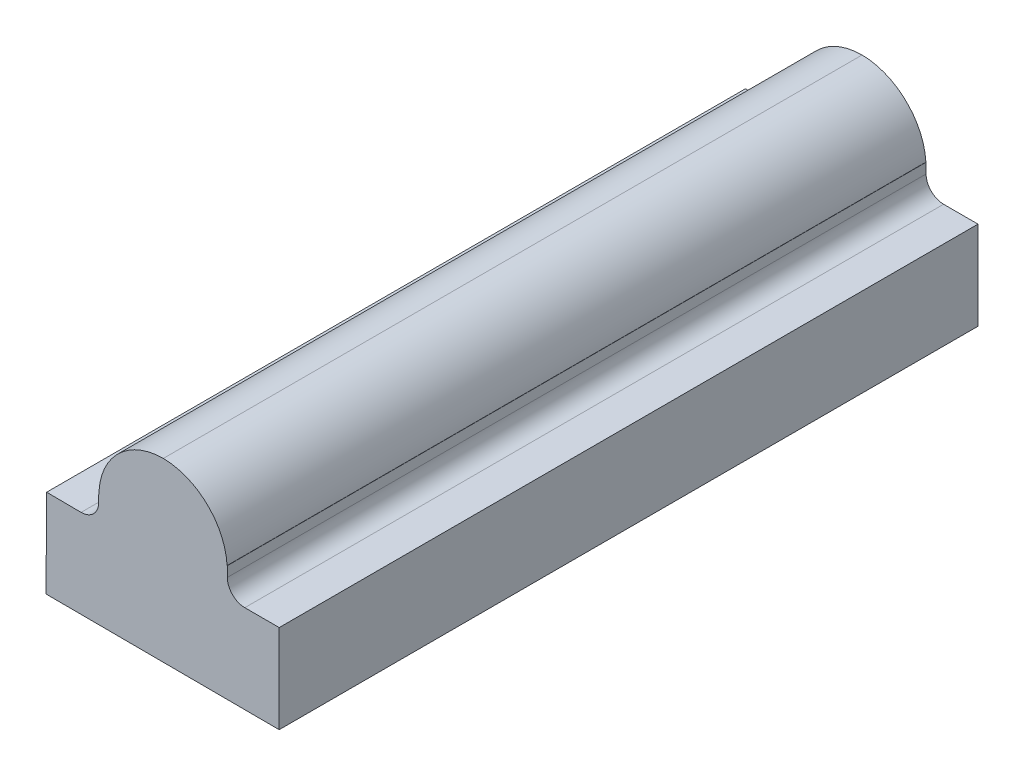
ISO-10303-21;
HEADER;
FILE_DESCRIPTION(('STEP AP214'),'2;1');
FILE_NAME('part.step','',(''),(''),'','','');
FILE_SCHEMA(('AUTOMOTIVE_DESIGN { 1 0 10303 214 1 1 1 1 }'));
ENDSEC;
DATA;
#1=APPLICATION_CONTEXT('core data for automotive mechanical design processes');
#2=APPLICATION_PROTOCOL_DEFINITION('international standard','automotive_design',2000,#1);
#3=PRODUCT_CONTEXT('',#1,'mechanical');
#4=PRODUCT('Part','Part','',(#3));
#5=PRODUCT_RELATED_PRODUCT_CATEGORY('part','',(#4));
#6=PRODUCT_DEFINITION_FORMATION('','',#4);
#7=PRODUCT_DEFINITION_CONTEXT('part definition',#1,'design');
#8=PRODUCT_DEFINITION('design','',#6,#7);
#9=PRODUCT_DEFINITION_SHAPE('','',#8);
#10=(LENGTH_UNIT() NAMED_UNIT(*) SI_UNIT(.MILLI.,.METRE.));
#11=(NAMED_UNIT(*) PLANE_ANGLE_UNIT() SI_UNIT($,.RADIAN.));
#12=(NAMED_UNIT(*) SI_UNIT($,.STERADIAN.) SOLID_ANGLE_UNIT());
#13=UNCERTAINTY_MEASURE_WITH_UNIT(LENGTH_MEASURE(1.E-05),#10,'distance_accuracy_value','');
#14=(GEOMETRIC_REPRESENTATION_CONTEXT(3) GLOBAL_UNCERTAINTY_ASSIGNED_CONTEXT((#13)) GLOBAL_UNIT_ASSIGNED_CONTEXT((#10,
#11,#12)) REPRESENTATION_CONTEXT('',''));
#15=CARTESIAN_POINT('',(0.,0.,0.));
#16=DIRECTION('',(0.,0.,1.));
#17=DIRECTION('',(1.,0.,0.));
#18=AXIS2_PLACEMENT_3D('',#15,#16,#17);
#19=CARTESIAN_POINT('',(-14.5610189157641,43.254441665146,3.));
#20=DIRECTION('',(0.,0.,-1.));
#21=DIRECTION('',(-1.,0.,0.));
#22=AXIS2_PLACEMENT_3D('',#19,#20,#21);
#23=CYLINDRICAL_SURFACE('',#22,0.555000000000011);
#24=CARTESIAN_POINT('',(-14.5610189157641,43.254441665146,-3.));
#25=DIRECTION('',(0.,0.,1.));
#26=DIRECTION('',(1.,0.,0.));
#27=AXIS2_PLACEMENT_3D('',#24,#25,#26);
#28=CIRCLE('',#27,0.555000000000011);
#29=CARTESIAN_POINT('',(-14.0069614198133,43.286772628335,-3.));
#30=VERTEX_POINT('',#29);
#31=CARTESIAN_POINT('',(-14.5548588552216,43.8094074781959,-3.));
#32=VERTEX_POINT('',#31);
#33=EDGE_CURVE('E211',#30,#32,#28,.T.);
#34=ORIENTED_EDGE('',*,*,#33,.T.);
#35=DIRECTION('',(0.,0.,-1.));
#36=VECTOR('',#35,1.);
#37=CARTESIAN_POINT('',(-14.5548588552216,43.8094074781959,3.));
#38=LINE('',#37,#36);
#39=CARTESIAN_POINT('',(-14.5548588552216,43.8094074781959,3.));
#40=VERTEX_POINT('',#39);
#41=EDGE_CURVE('E43',#40,#32,#38,.T.);
#42=ORIENTED_EDGE('',*,*,#41,.F.);
#43=CARTESIAN_POINT('',(-14.5610189157641,43.254441665146,3.));
#44=DIRECTION('',(0.,0.,1.));
#45=DIRECTION('',(1.,0.,0.));
#46=AXIS2_PLACEMENT_3D('',#43,#44,#45);
#47=CIRCLE('',#46,0.555000000000011);
#48=CARTESIAN_POINT('',(-14.0069614198133,43.286772628335,3.));
#49=VERTEX_POINT('',#48);
#50=EDGE_CURVE('E212',#49,#40,#47,.T.);
#51=ORIENTED_EDGE('',*,*,#50,.F.);
#52=DIRECTION('',(0.,0.,-1.));
#53=VECTOR('',#52,1.);
#54=CARTESIAN_POINT('',(-14.0069614198133,43.286772628335,3.));
#55=LINE('',#54,#53);
#56=EDGE_CURVE('E225',#49,#30,#55,.T.);
#57=ORIENTED_EDGE('',*,*,#56,.T.);
#58=EDGE_LOOP('',(#34,#42,#51,#57));
#59=FACE_BOUND('',#58,.T.);
#60=ADVANCED_FACE('F34',(#59),#23,.T.);
#61=CARTESIAN_POINT('',(-14.5600764117149,42.536772628335,3.));
#62=DIRECTION('',(1.,0.,0.));
#63=DIRECTION('',(0.,0.,-1.));
#64=AXIS2_PLACEMENT_3D('',#61,#62,#63);
#65=PLANE('',#64);
#66=DIRECTION('',(0.,-1.,0.));
#67=VECTOR('',#66,1.);
#68=CARTESIAN_POINT('',(-14.5600764117149,42.536772628335,-3.));
#69=LINE('',#68,#67);
#70=CARTESIAN_POINT('',(-14.5600764117149,42.536772628335,-3.));
#71=VERTEX_POINT('',#70);
#72=CARTESIAN_POINT('',(-14.5600764117149,42.2935072825846,-3.));
#73=VERTEX_POINT('',#72);
#74=EDGE_CURVE('E227',#71,#73,#69,.T.);
#75=ORIENTED_EDGE('',*,*,#74,.T.);
#76=DIRECTION('',(0.,0.,1.));
#77=VECTOR('',#76,1.);
#78=CARTESIAN_POINT('',(-14.5600764117149,42.2935072825846,3.));
#79=LINE('',#78,#77);
#80=CARTESIAN_POINT('',(-14.5600764117149,42.2935072825846,3.));
#81=VERTEX_POINT('',#80);
#82=EDGE_CURVE('E160',#73,#81,#79,.T.);
#83=ORIENTED_EDGE('',*,*,#82,.T.);
#84=DIRECTION('',(0.,-1.,0.));
#85=VECTOR('',#84,1.);
#86=CARTESIAN_POINT('',(-14.5600764117149,42.536772628335,3.));
#87=LINE('',#86,#85);
#88=CARTESIAN_POINT('',(-14.5600764117149,42.536772628335,3.));
#89=VERTEX_POINT('',#88);
#90=EDGE_CURVE('E214',#89,#81,#87,.T.);
#91=ORIENTED_EDGE('',*,*,#90,.F.);
#92=DIRECTION('',(0.,0.,-1.));
#93=VECTOR('',#92,1.);
#94=CARTESIAN_POINT('',(-14.5600764117149,42.536772628335,3.));
#95=LINE('',#94,#93);
#96=EDGE_CURVE('E248',#89,#71,#95,.T.);
#97=ORIENTED_EDGE('',*,*,#96,.T.);
#98=EDGE_LOOP('',(#75,#83,#91,#97));
#99=FACE_BOUND('',#98,.T.);
#100=ADVANCED_FACE('F310',(#99),#65,.F.);
#101=CARTESIAN_POINT('',(-13.2638702513963,43.0494074781959,3.));
#102=DIRECTION('',(0.,-1.,0.));
#103=DIRECTION('',(1.,0.,0.));
#104=AXIS2_PLACEMENT_3D('',#101,#102,#103);
#105=PLANE('',#104);
#106=DIRECTION('',(-1.,0.,0.));
#107=VECTOR('',#106,1.);
#108=CARTESIAN_POINT('',(-13.2638702513963,43.0494074781959,3.));
#109=LINE('',#108,#107);
#110=CARTESIAN_POINT('',(-13.5594733315556,43.0494074781959,3.));
#111=VERTEX_POINT('',#110);
#112=CARTESIAN_POINT('',(-13.8550764117149,43.0494074781959,3.));
#113=VERTEX_POINT('',#112);
#114=EDGE_CURVE('E37',#111,#113,#109,.T.);
#115=ORIENTED_EDGE('',*,*,#114,.F.);
#116=DIRECTION('',(0.,0.,1.));
#117=VECTOR('',#116,1.);
#118=CARTESIAN_POINT('',(-13.5594733315556,43.0494074781959,-3.));
#119=LINE('',#118,#117);
#120=CARTESIAN_POINT('',(-13.5594733315556,43.0494074781959,-3.));
#121=VERTEX_POINT('',#120);
#122=EDGE_CURVE('E281',#121,#111,#119,.T.);
#123=ORIENTED_EDGE('',*,*,#122,.F.);
#124=DIRECTION('',(-1.,0.,0.));
#125=VECTOR('',#124,1.);
#126=CARTESIAN_POINT('',(-13.2638702513963,43.0494074781959,-3.));
#127=LINE('',#126,#125);
#128=CARTESIAN_POINT('',(-13.8550764117149,43.0494074781959,-3.));
#129=VERTEX_POINT('',#128);
#130=EDGE_CURVE('E230',#121,#129,#127,.T.);
#131=ORIENTED_EDGE('',*,*,#130,.T.);
#132=DIRECTION('',(0.,0.,-1.));
#133=VECTOR('',#132,1.);
#134=CARTESIAN_POINT('',(-13.8550764117149,43.0494074781959,3.));
#135=LINE('',#134,#133);
#136=EDGE_CURVE('E245',#113,#129,#135,.T.);
#137=ORIENTED_EDGE('',*,*,#136,.F.);
#138=EDGE_LOOP('',(#115,#123,#131,#137));
#139=FACE_BOUND('',#138,.T.);
#140=ADVANCED_FACE('F319',(#139),#105,.F.);
#141=CARTESIAN_POINT('',(-13.8550764117149,43.1994074781959,3.));
#142=DIRECTION('',(0.,0.,-1.));
#143=DIRECTION('',(-1.,0.,0.));
#144=AXIS2_PLACEMENT_3D('',#141,#142,#143);
#145=CYLINDRICAL_SURFACE('',#144,0.149999999999998);
#146=CARTESIAN_POINT('',(-13.8550764117149,43.1994074781959,-3.));
#147=DIRECTION('',(0.,0.,-1.));
#148=DIRECTION('',(1.,0.,0.));
#149=AXIS2_PLACEMENT_3D('',#146,#147,#148);
#150=CIRCLE('',#149,0.149999999999998);
#151=CARTESIAN_POINT('',(-14.0050764117149,43.1994074781959,-3.));
#152=VERTEX_POINT('',#151);
#153=EDGE_CURVE('E232',#129,#152,#150,.T.);
#154=ORIENTED_EDGE('',*,*,#153,.T.);
#155=DIRECTION('',(0.,0.,-1.));
#156=VECTOR('',#155,1.);
#157=CARTESIAN_POINT('',(-14.0050764117149,43.1994074781959,3.));
#158=LINE('',#157,#156);
#159=CARTESIAN_POINT('',(-14.0050764117149,43.1994074781959,3.));
#160=VERTEX_POINT('',#159);
#161=EDGE_CURVE('E242',#160,#152,#158,.T.);
#162=ORIENTED_EDGE('',*,*,#161,.F.);
#163=CARTESIAN_POINT('',(-13.8550764117149,43.1994074781959,3.));
#164=DIRECTION('',(0.,0.,-1.));
#165=DIRECTION('',(1.,0.,0.));
#166=AXIS2_PLACEMENT_3D('',#163,#164,#165);
#167=CIRCLE('',#166,0.149999999999998);
#168=EDGE_CURVE('E219',#113,#160,#167,.T.);
#169=ORIENTED_EDGE('',*,*,#168,.F.);
#170=ORIENTED_EDGE('',*,*,#136,.T.);
#171=EDGE_LOOP('',(#154,#162,#169,#170));
#172=FACE_BOUND('',#171,.T.);
#173=ADVANCED_FACE('F326',(#172),#145,.F.);
#174=CARTESIAN_POINT('',(-14.0050764117149,43.1994074781959,3.));
#175=DIRECTION('',(-1.,0.,0.));
#176=DIRECTION('',(0.,0.,1.));
#177=AXIS2_PLACEMENT_3D('',#174,#175,#176);
#178=PLANE('',#177);
#179=DIRECTION('',(0.,1.,0.));
#180=VECTOR('',#179,1.);
#181=CARTESIAN_POINT('',(-14.0050764117149,43.1994074781959,-3.));
#182=LINE('',#181,#180);
#183=CARTESIAN_POINT('',(-14.0050764117149,43.286772628335,-3.));
#184=VERTEX_POINT('',#183);
#185=EDGE_CURVE('E234',#152,#184,#182,.T.);
#186=ORIENTED_EDGE('',*,*,#185,.T.);
#187=DIRECTION('',(0.,0.,-1.));
#188=VECTOR('',#187,1.);
#189=CARTESIAN_POINT('',(-14.0050764117149,43.286772628335,3.));
#190=LINE('',#189,#188);
#191=CARTESIAN_POINT('',(-14.0050764117149,43.286772628335,3.));
#192=VERTEX_POINT('',#191);
#193=EDGE_CURVE('E239',#192,#184,#190,.T.);
#194=ORIENTED_EDGE('',*,*,#193,.F.);
#195=DIRECTION('',(0.,1.,0.));
#196=VECTOR('',#195,1.);
#197=CARTESIAN_POINT('',(-14.0050764117149,43.1994074781959,3.));
#198=LINE('',#197,#196);
#199=EDGE_CURVE('E221',#160,#192,#198,.T.);
#200=ORIENTED_EDGE('',*,*,#199,.F.);
#201=ORIENTED_EDGE('',*,*,#161,.T.);
#202=EDGE_LOOP('',(#186,#194,#200,#201));
#203=FACE_BOUND('',#202,.T.);
#204=ADVANCED_FACE('F329',(#203),#178,.F.);
#205=CARTESIAN_POINT('',(-14.0050764117149,43.286772628335,3.));
#206=DIRECTION('',(0.,-1.,0.));
#207=DIRECTION('',(0.,0.,-1.));
#208=AXIS2_PLACEMENT_3D('',#205,#206,#207);
#209=PLANE('',#208);
#210=DIRECTION('',(-1.,0.,0.));
#211=VECTOR('',#210,1.);
#212=CARTESIAN_POINT('',(-14.0050764117149,43.286772628335,-3.));
#213=LINE('',#212,#211);
#214=EDGE_CURVE('E215',#184,#30,#213,.T.);
#215=ORIENTED_EDGE('',*,*,#214,.T.);
#216=ORIENTED_EDGE('',*,*,#56,.F.);
#217=DIRECTION('',(-1.,0.,0.));
#218=VECTOR('',#217,1.);
#219=CARTESIAN_POINT('',(-14.0050764117149,43.286772628335,3.));
#220=LINE('',#219,#218);
#221=EDGE_CURVE('E223',#192,#49,#220,.T.);
#222=ORIENTED_EDGE('',*,*,#221,.F.);
#223=ORIENTED_EDGE('',*,*,#193,.T.);
#224=EDGE_LOOP('',(#215,#216,#222,#223));
#225=FACE_BOUND('',#224,.T.);
#226=ADVANCED_FACE('F333',(#225),#209,.F.);
#227=CARTESIAN_POINT('',(-14.5610189157641,43.254441665146,3.));
#228=DIRECTION('',(0.,0.,1.));
#229=DIRECTION('',(1.,0.,0.));
#230=AXIS2_PLACEMENT_3D('',#227,#228,#229);
#231=PLANE('',#230);
#232=DIRECTION('',(0.00740532956584294,0.999972580171087,0.));
#233=VECTOR('',#232,1.);
#234=CARTESIAN_POINT('',(-15.5549302538437,43.2618021079858,3.));
#235=LINE('',#234,#233);
#236=CARTESIAN_POINT('',(-15.5620705709679,42.2976152646443,3.));
#237=VERTEX_POINT('',#236);
#238=CARTESIAN_POINT('',(-15.5564425187231,43.0575946652359,3.000006));
#239=VERTEX_POINT('',#238);
#240=EDGE_CURVE('E149',#237,#239,#235,.T.);
#241=ORIENTED_EDGE('',*,*,#240,.F.);
#242=DIRECTION('',(-0.999991595899715,0.0040997719377291,0.));
#243=VECTOR('',#242,1.);
#244=CARTESIAN_POINT('',(-14.5649584786291,42.2935272981137,3.));
#245=LINE('',#244,#243);
#246=CARTESIAN_POINT('',(-14.5620710598274,42.2935154602557,3.));
#247=VERTEX_POINT('',#246);
#248=EDGE_CURVE('E169',#247,#237,#245,.T.);
#249=ORIENTED_EDGE('',*,*,#248,.F.);
#250=DIRECTION('',(-0.00819947496566511,-0.999966383740117,0.));
#251=VECTOR('',#250,1.);
#252=CARTESIAN_POINT('',(-14.5600764117149,42.536772628335,3.));
#253=LINE('',#252,#251);
#254=EDGE_CURVE('E176',#89,#247,#253,.T.);
#255=ORIENTED_EDGE('',*,*,#254,.F.);
#256=ORIENTED_EDGE('',*,*,#90,.T.);
#257=CARTESIAN_POINT('',(-13.5600769005744,42.2894074781959,3.));
#258=VERTEX_POINT('',#257);
#259=EDGE_CURVE('E295',#258,#81,#245,.T.);
#260=ORIENTED_EDGE('',*,*,#259,.F.);
#261=DIRECTION('',(-0.000794169511106905,-0.999999684647344,0.));
#262=VECTOR('',#261,1.);
#263=CARTESIAN_POINT('',(-13.559311131387,43.2536461391137,3.));
#264=LINE('',#263,#262);
#265=EDGE_CURVE('E159',#111,#258,#264,.T.);
#266=ORIENTED_EDGE('',*,*,#265,.F.);
#267=ORIENTED_EDGE('',*,*,#114,.T.);
#268=ORIENTED_EDGE('',*,*,#168,.T.);
#269=ORIENTED_EDGE('',*,*,#199,.T.);
#270=ORIENTED_EDGE('',*,*,#221,.T.);
#271=ORIENTED_EDGE('',*,*,#50,.T.);
#272=CARTESIAN_POINT('',(-14.5532494300482,43.2544098117588,3.));
#273=DIRECTION('',(0.,0.,-1.));
#274=DIRECTION('',(-0.999966383740117,0.0081994749656651,0.));
#275=AXIS2_PLACEMENT_3D('',#272,#273,#274);
#276=CIRCLE('',#275,0.555000000000011);
#277=CARTESIAN_POINT('',(-15.107023203735,43.2912826686693,3.));
#278=VERTEX_POINT('',#277);
#279=EDGE_CURVE('E203',#278,#40,#276,.T.);
#280=ORIENTED_EDGE('',*,*,#279,.F.);
#281=DIRECTION('',(0.999966383740117,-0.0081994749656651,0.));
#282=VECTOR('',#281,1.);
#283=CARTESIAN_POINT('',(-15.1089081484664,43.291298124746,3.));
#284=LINE('',#283,#282);
#285=CARTESIAN_POINT('',(-15.1089081484664,43.291298124746,3.));
#286=VERTEX_POINT('',#285);
#287=EDGE_CURVE('E268',#286,#278,#284,.T.);
#288=ORIENTED_EDGE('',*,*,#287,.F.);
#289=DIRECTION('',(0.00819947496566511,0.999966383740117,0.));
#290=VECTOR('',#289,1.);
#291=CARTESIAN_POINT('',(-15.1096244968279,43.2039359114965,3.));
#292=LINE('',#291,#290);
#293=CARTESIAN_POINT('',(-15.1096244968279,43.2039359114965,3.));
#294=VERTEX_POINT('',#293);
#295=EDGE_CURVE('E180',#294,#286,#292,.T.);
#296=ORIENTED_EDGE('',*,*,#295,.F.);
#297=CARTESIAN_POINT('',(-15.2596194543889,43.2051658327414,3.));
#298=DIRECTION('',(0.,0.,1.));
#299=DIRECTION('',(-0.999966383740117,0.0081994749656651,0.));
#300=AXIS2_PLACEMENT_3D('',#297,#298,#299);
#301=CIRCLE('',#300,0.149999999999998);
#302=CARTESIAN_POINT('',(-15.2608493756337,43.0551708751804,3.));
#303=VERTEX_POINT('',#302);
#304=EDGE_CURVE('E175',#303,#294,#301,.T.);
#305=ORIENTED_EDGE('',*,*,#304,.F.);
#306=DIRECTION('',(0.999966383740118,-0.00819947496562989,0.));
#307=VECTOR('',#306,1.);
#308=CARTESIAN_POINT('',(-15.8520356618124,43.0600184552914,3.));
#309=LINE('',#308,#307);
#310=EDGE_CURVE('E166',#239,#303,#309,.T.);
#311=ORIENTED_EDGE('',*,*,#310,.F.);
#312=EDGE_LOOP('',(#241,#249,#255,#256,#260,#266,#267,#268,#269,#270,#271,#280,#288,#296,#305,#311));
#313=FACE_BOUND('',#312,.T.);
#314=ADVANCED_FACE('F172',(#313),#231,.T.);
#315=CARTESIAN_POINT('',(-14.5610189157641,43.254441665146,-3.));
#316=DIRECTION('',(0.,0.,1.));
#317=DIRECTION('',(1.,0.,0.));
#318=AXIS2_PLACEMENT_3D('',#315,#316,#317);
#319=PLANE('',#318);
#320=DIRECTION('',(-0.999991595899715,0.0040997719377291,0.));
#321=VECTOR('',#320,1.);
#322=CARTESIAN_POINT('',(-15.5620705709679,42.2976152646443,-3.));
#323=LINE('',#322,#321);
#324=CARTESIAN_POINT('',(-14.5620710598274,42.2935154602557,-3.));
#325=VERTEX_POINT('',#324);
#326=CARTESIAN_POINT('',(-15.5620705709679,42.2976152646443,-3.));
#327=VERTEX_POINT('',#326);
#328=EDGE_CURVE('E58',#325,#327,#323,.T.);
#329=ORIENTED_EDGE('',*,*,#328,.T.);
#330=DIRECTION('',(0.00740532956584294,0.999972580171087,0.));
#331=VECTOR('',#330,1.);
#332=CARTESIAN_POINT('',(-15.5564425187231,43.0575946652359,-3.));
#333=LINE('',#332,#331);
#334=CARTESIAN_POINT('',(-15.5564425187231,43.0575946652359,-3.));
#335=VERTEX_POINT('',#334);
#336=EDGE_CURVE('E280',#327,#335,#333,.T.);
#337=ORIENTED_EDGE('',*,*,#336,.T.);
#338=DIRECTION('',(0.999966383740118,-0.00819947496562989,0.));
#339=VECTOR('',#338,1.);
#340=CARTESIAN_POINT('',(-15.8520356618124,43.0600184552914,-3.));
#341=LINE('',#340,#339);
#342=CARTESIAN_POINT('',(-15.2608493756337,43.0551708751804,-3.));
#343=VERTEX_POINT('',#342);
#344=EDGE_CURVE('E168',#335,#343,#341,.T.);
#345=ORIENTED_EDGE('',*,*,#344,.T.);
#346=CARTESIAN_POINT('',(-15.2596194543889,43.2051658327414,-3.));
#347=DIRECTION('',(0.,0.,1.));
#348=DIRECTION('',(-0.999966383740117,0.0081994749656651,0.));
#349=AXIS2_PLACEMENT_3D('',#346,#347,#348);
#350=CIRCLE('',#349,0.149999999999998);
#351=CARTESIAN_POINT('',(-15.1096244968279,43.2039359114965,-3.));
#352=VERTEX_POINT('',#351);
#353=EDGE_CURVE('E196',#343,#352,#350,.T.);
#354=ORIENTED_EDGE('',*,*,#353,.T.);
#355=DIRECTION('',(0.00819947496566511,0.999966383740117,0.));
#356=VECTOR('',#355,1.);
#357=CARTESIAN_POINT('',(-15.1096244968279,43.2039359114965,-3.));
#358=LINE('',#357,#356);
#359=CARTESIAN_POINT('',(-15.1089081484664,43.291298124746,-3.));
#360=VERTEX_POINT('',#359);
#361=EDGE_CURVE('E193',#352,#360,#358,.T.);
#362=ORIENTED_EDGE('',*,*,#361,.T.);
#363=DIRECTION('',(0.999966383740117,-0.0081994749656651,0.));
#364=VECTOR('',#363,1.);
#365=CARTESIAN_POINT('',(-15.1089081484664,43.291298124746,-3.));
#366=LINE('',#365,#364);
#367=CARTESIAN_POINT('',(-15.107023203735,43.2912826686693,-3.));
#368=VERTEX_POINT('',#367);
#369=EDGE_CURVE('E190',#360,#368,#366,.T.);
#370=ORIENTED_EDGE('',*,*,#369,.T.);
#371=CARTESIAN_POINT('',(-14.5532494300482,43.2544098117588,-3.));
#372=DIRECTION('',(0.,0.,-1.));
#373=DIRECTION('',(-0.999966383740117,0.0081994749656651,0.));
#374=AXIS2_PLACEMENT_3D('',#371,#372,#373);
#375=CIRCLE('',#374,0.555000000000011);
#376=EDGE_CURVE('E187',#368,#32,#375,.T.);
#377=ORIENTED_EDGE('',*,*,#376,.T.);
#378=ORIENTED_EDGE('',*,*,#33,.F.);
#379=ORIENTED_EDGE('',*,*,#214,.F.);
#380=ORIENTED_EDGE('',*,*,#185,.F.);
#381=ORIENTED_EDGE('',*,*,#153,.F.);
#382=ORIENTED_EDGE('',*,*,#130,.F.);
#383=DIRECTION('',(-0.000794169511106905,-0.999999684647344,0.));
#384=VECTOR('',#383,1.);
#385=CARTESIAN_POINT('',(-13.5600769005744,42.2894074781959,-3.));
#386=LINE('',#385,#384);
#387=CARTESIAN_POINT('',(-13.5600769005744,42.2894074781959,-3.));
#388=VERTEX_POINT('',#387);
#389=EDGE_CURVE('E316',#121,#388,#386,.T.);
#390=ORIENTED_EDGE('',*,*,#389,.T.);
#391=EDGE_CURVE('E51',#388,#73,#323,.T.);
#392=ORIENTED_EDGE('',*,*,#391,.T.);
#393=ORIENTED_EDGE('',*,*,#74,.F.);
#394=DIRECTION('',(-0.00819947496566511,-0.999966383740117,0.));
#395=VECTOR('',#394,1.);
#396=CARTESIAN_POINT('',(-14.5600764117149,42.536772628335,-3.));
#397=LINE('',#396,#395);
#398=EDGE_CURVE('E200',#71,#325,#397,.T.);
#399=ORIENTED_EDGE('',*,*,#398,.T.);
#400=EDGE_LOOP('',(#329,#337,#345,#354,#362,#370,#377,#378,#379,#380,#381,#382,#390,#392,#393,#399));
#401=FACE_BOUND('',#400,.T.);
#402=ADVANCED_FACE('F260',(#401),#319,.F.);
#403=CARTESIAN_POINT('',(-14.5532494300482,43.2544098117588,3.));
#404=DIRECTION('',(0.,0.,-1.));
#405=DIRECTION('',(-1.,0.,0.));
#406=AXIS2_PLACEMENT_3D('',#403,#404,#405);
#407=CYLINDRICAL_SURFACE('',#406,0.555000000000011);
#408=ORIENTED_EDGE('',*,*,#376,.F.);
#409=DIRECTION('',(0.,0.,-1.));
#410=VECTOR('',#409,1.);
#411=CARTESIAN_POINT('',(-15.107023203735,43.2912826686693,3.));
#412=LINE('',#411,#410);
#413=EDGE_CURVE('E209',#278,#368,#412,.T.);
#414=ORIENTED_EDGE('',*,*,#413,.F.);
#415=ORIENTED_EDGE('',*,*,#279,.T.);
#416=ORIENTED_EDGE('',*,*,#41,.T.);
#417=EDGE_LOOP('',(#408,#414,#415,#416));
#418=FACE_BOUND('',#417,.T.);
#419=ADVANCED_FACE('F254',(#418),#407,.T.);
#420=CARTESIAN_POINT('',(-15.1089081484664,43.291298124746,3.));
#421=DIRECTION('',(0.0081994749656651,0.999966383740117,0.));
#422=DIRECTION('',(-0.999966383740117,0.0081994749656651,0.));
#423=AXIS2_PLACEMENT_3D('',#420,#421,#422);
#424=PLANE('',#423);
#425=ORIENTED_EDGE('',*,*,#369,.F.);
#426=DIRECTION('',(0.,0.,-1.));
#427=VECTOR('',#426,1.);
#428=CARTESIAN_POINT('',(-15.1089081484664,43.291298124746,3.));
#429=LINE('',#428,#427);
#430=EDGE_CURVE('E207',#286,#360,#429,.T.);
#431=ORIENTED_EDGE('',*,*,#430,.F.);
#432=ORIENTED_EDGE('',*,*,#287,.T.);
#433=ORIENTED_EDGE('',*,*,#413,.T.);
#434=EDGE_LOOP('',(#425,#431,#432,#433));
#435=FACE_BOUND('',#434,.T.);
#436=ADVANCED_FACE('F265',(#435),#424,.T.);
#437=CARTESIAN_POINT('',(-15.1096244968279,43.2039359114965,3.));
#438=DIRECTION('',(-0.999966383740117,0.00819947496566511,0.));
#439=DIRECTION('',(-0.00819947496566511,-0.999966383740117,0.));
#440=AXIS2_PLACEMENT_3D('',#437,#438,#439);
#441=PLANE('',#440);
#442=ORIENTED_EDGE('',*,*,#361,.F.);
#443=DIRECTION('',(0.,0.,-1.));
#444=VECTOR('',#443,1.);
#445=CARTESIAN_POINT('',(-15.1096244968279,43.2039359114965,3.));
#446=LINE('',#445,#444);
#447=EDGE_CURVE('E205',#294,#352,#446,.T.);
#448=ORIENTED_EDGE('',*,*,#447,.F.);
#449=ORIENTED_EDGE('',*,*,#295,.T.);
#450=ORIENTED_EDGE('',*,*,#430,.T.);
#451=EDGE_LOOP('',(#442,#448,#449,#450));
#452=FACE_BOUND('',#451,.T.);
#453=ADVANCED_FACE('F276',(#452),#441,.T.);
#454=CARTESIAN_POINT('',(-15.2596194543889,43.2051658327414,3.));
#455=DIRECTION('',(0.,0.,-1.));
#456=DIRECTION('',(-1.,0.,0.));
#457=AXIS2_PLACEMENT_3D('',#454,#455,#456);
#458=CYLINDRICAL_SURFACE('',#457,0.149999999999998);
#459=ORIENTED_EDGE('',*,*,#353,.F.);
#460=DIRECTION('',(0.,0.,-1.));
#461=VECTOR('',#460,1.);
#462=CARTESIAN_POINT('',(-15.2608493756337,43.0551708751804,3.));
#463=LINE('',#462,#461);
#464=EDGE_CURVE('E178',#303,#343,#463,.T.);
#465=ORIENTED_EDGE('',*,*,#464,.F.);
#466=ORIENTED_EDGE('',*,*,#304,.T.);
#467=ORIENTED_EDGE('',*,*,#447,.T.);
#468=EDGE_LOOP('',(#459,#465,#466,#467));
#469=FACE_BOUND('',#468,.T.);
#470=ADVANCED_FACE('F279',(#469),#458,.F.);
#471=CARTESIAN_POINT('',(-15.8520356618124,43.0600184552914,3.));
#472=DIRECTION('',(0.00819947496562989,0.999966383740117,0.));
#473=DIRECTION('',(-0.999966383740118,0.00819947496562989,0.));
#474=AXIS2_PLACEMENT_3D('',#471,#472,#473);
#475=PLANE('',#474);
#476=DIRECTION('',(0.,0.,1.));
#477=VECTOR('',#476,1.);
#478=CARTESIAN_POINT('',(-15.5564425187231,43.0575946652359,-3.));
#479=LINE('',#478,#477);
#480=EDGE_CURVE('E153',#335,#239,#479,.T.);
#481=ORIENTED_EDGE('',*,*,#480,.T.);
#482=ORIENTED_EDGE('',*,*,#310,.T.);
#483=ORIENTED_EDGE('',*,*,#464,.T.);
#484=ORIENTED_EDGE('',*,*,#344,.F.);
#485=EDGE_LOOP('',(#481,#482,#483,#484));
#486=FACE_BOUND('',#485,.T.);
#487=ADVANCED_FACE('F164',(#486),#475,.T.);
#488=CARTESIAN_POINT('',(-14.5600764117149,42.536772628335,3.));
#489=DIRECTION('',(0.999966383740117,-0.00819947496566511,0.));
#490=DIRECTION('',(0.00819947496566511,0.999966383740117,0.));
#491=AXIS2_PLACEMENT_3D('',#488,#489,#490);
#492=PLANE('',#491);
#493=DIRECTION('',(0.,0.,1.));
#494=VECTOR('',#493,1.);
#495=CARTESIAN_POINT('',(-14.5620710598274,42.2935154602557,3.));
#496=LINE('',#495,#494);
#497=EDGE_CURVE('E11',#325,#247,#496,.T.);
#498=ORIENTED_EDGE('',*,*,#497,.F.);
#499=ORIENTED_EDGE('',*,*,#398,.F.);
#500=ORIENTED_EDGE('',*,*,#96,.F.);
#501=ORIENTED_EDGE('',*,*,#254,.T.);
#502=EDGE_LOOP('',(#498,#499,#500,#501));
#503=FACE_BOUND('',#502,.T.);
#504=ADVANCED_FACE('F314',(#503),#492,.T.);
#505=CARTESIAN_POINT('',(-15.5620705709679,42.2976152646443,-3.));
#506=DIRECTION('',(0.0040997719377291,0.999991595899715,0.));
#507=DIRECTION('',(-0.999991595899715,0.0040997719377291,0.));
#508=AXIS2_PLACEMENT_3D('',#505,#506,#507);
#509=PLANE('',#508);
#510=ORIENTED_EDGE('',*,*,#248,.T.);
#511=DIRECTION('',(0.,0.,1.));
#512=VECTOR('',#511,1.);
#513=CARTESIAN_POINT('',(-15.5620705709679,42.2976152646443,-3.));
#514=LINE('',#513,#512);
#515=EDGE_CURVE('E155',#327,#237,#514,.T.);
#516=ORIENTED_EDGE('',*,*,#515,.F.);
#517=ORIENTED_EDGE('',*,*,#328,.F.);
#518=ORIENTED_EDGE('',*,*,#497,.T.);
#519=EDGE_LOOP('',(#510,#516,#517,#518));
#520=FACE_BOUND('',#519,.T.);
#521=ADVANCED_FACE('F365',(#520),#509,.F.);
#522=CARTESIAN_POINT('',(-15.5564425187231,43.0575946652359,-3.));
#523=DIRECTION('',(0.999972580171087,-0.00740532956584294,0.));
#524=DIRECTION('',(0.00740532956584294,0.999972580171087,0.));
#525=AXIS2_PLACEMENT_3D('',#522,#523,#524);
#526=PLANE('',#525);
#527=ORIENTED_EDGE('',*,*,#240,.T.);
#528=ORIENTED_EDGE('',*,*,#480,.F.);
#529=ORIENTED_EDGE('',*,*,#336,.F.);
#530=ORIENTED_EDGE('',*,*,#515,.T.);
#531=EDGE_LOOP('',(#527,#528,#529,#530));
#532=FACE_BOUND('',#531,.T.);
#533=ADVANCED_FACE('F151',(#532),#526,.F.);
#534=ORIENTED_EDGE('',*,*,#391,.F.);
#535=DIRECTION('',(0.,0.,1.));
#536=VECTOR('',#535,1.);
#537=CARTESIAN_POINT('',(-13.5600769005744,42.2894074781959,-3.));
#538=LINE('',#537,#536);
#539=EDGE_CURVE('E283',#388,#258,#538,.T.);
#540=ORIENTED_EDGE('',*,*,#539,.T.);
#541=ORIENTED_EDGE('',*,*,#259,.T.);
#542=ORIENTED_EDGE('',*,*,#82,.F.);
#543=EDGE_LOOP('',(#534,#540,#541,#542));
#544=FACE_BOUND('',#543,.T.);
#545=ADVANCED_FACE('F306',(#544),#509,.F.);
#546=CARTESIAN_POINT('',(-13.5600769005744,42.2894074781959,-3.));
#547=DIRECTION('',(-0.999999684647344,0.000794169511106905,0.));
#548=DIRECTION('',(-0.000794169511106905,-0.999999684647344,0.));
#549=AXIS2_PLACEMENT_3D('',#546,#547,#548);
#550=PLANE('',#549);
#551=ORIENTED_EDGE('',*,*,#265,.T.);
#552=ORIENTED_EDGE('',*,*,#539,.F.);
#553=ORIENTED_EDGE('',*,*,#389,.F.);
#554=ORIENTED_EDGE('',*,*,#122,.T.);
#555=EDGE_LOOP('',(#551,#552,#553,#554));
#556=FACE_BOUND('',#555,.T.);
#557=ADVANCED_FACE('F301',(#556),#550,.F.);
#558=CLOSED_SHELL('',(#60,#100,#140,#173,#204,#226,#314,#402,#419,#436,#453,#470,#487,#504,#521,
#533,#545,#557));
#559=MANIFOLD_SOLID_BREP('B2',#558);
#560=ADVANCED_BREP_SHAPE_REPRESENTATION('',(#18,#559),#14);
#561=SHAPE_DEFINITION_REPRESENTATION(#9,#560);
ENDSEC;
END-ISO-10303-21;
